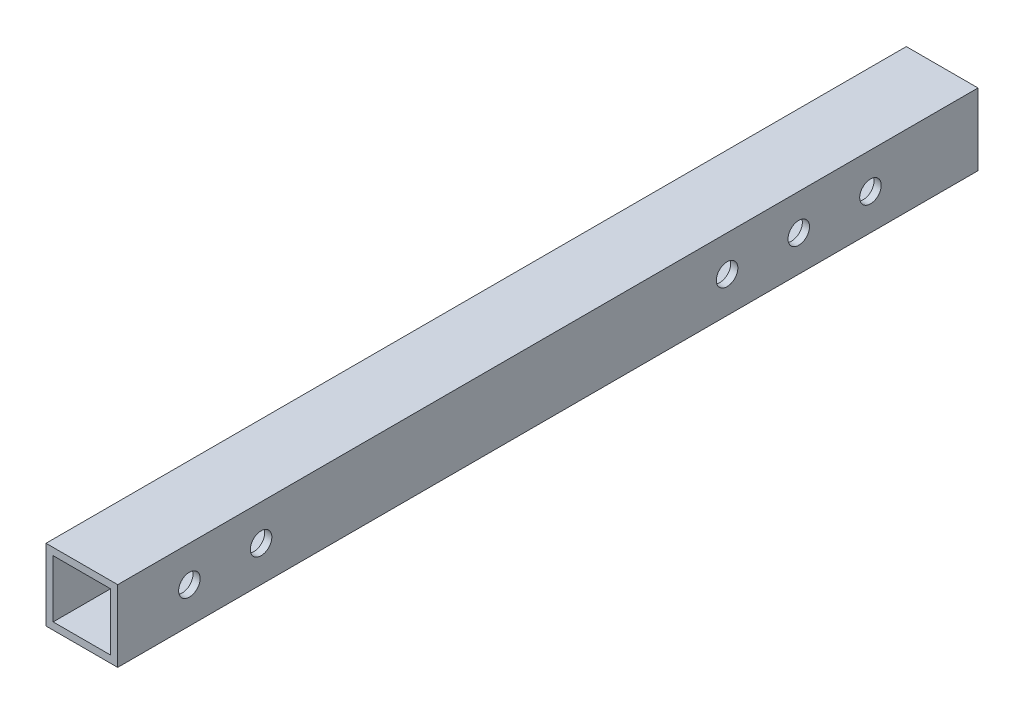
ISO-10303-21;
HEADER;
FILE_DESCRIPTION(('STEP AP214'),'2;1');
FILE_NAME('part.step','',(''),(''),'','','');
FILE_SCHEMA(('AUTOMOTIVE_DESIGN { 1 0 10303 214 1 1 1 1 }'));
ENDSEC;
DATA;
#1=APPLICATION_CONTEXT('core data for automotive mechanical design processes');
#2=APPLICATION_PROTOCOL_DEFINITION('international standard','automotive_design',2000,#1);
#3=PRODUCT_CONTEXT('',#1,'mechanical');
#4=PRODUCT('Part','Part','',(#3));
#5=PRODUCT_RELATED_PRODUCT_CATEGORY('part','',(#4));
#6=PRODUCT_DEFINITION_FORMATION('','',#4);
#7=PRODUCT_DEFINITION_CONTEXT('part definition',#1,'design');
#8=PRODUCT_DEFINITION('design','',#6,#7);
#9=PRODUCT_DEFINITION_SHAPE('','',#8);
#10=(LENGTH_UNIT() NAMED_UNIT(*) SI_UNIT(.MILLI.,.METRE.));
#11=(NAMED_UNIT(*) PLANE_ANGLE_UNIT() SI_UNIT($,.RADIAN.));
#12=(NAMED_UNIT(*) SI_UNIT($,.STERADIAN.) SOLID_ANGLE_UNIT());
#13=UNCERTAINTY_MEASURE_WITH_UNIT(LENGTH_MEASURE(1.E-05),#10,'distance_accuracy_value','');
#14=(GEOMETRIC_REPRESENTATION_CONTEXT(3) GLOBAL_UNCERTAINTY_ASSIGNED_CONTEXT((#13)) GLOBAL_UNIT_ASSIGNED_CONTEXT((#10,
#11,#12)) REPRESENTATION_CONTEXT('',''));
#15=CARTESIAN_POINT('',(0.,0.,0.));
#16=DIRECTION('',(0.,0.,1.));
#17=DIRECTION('',(1.,0.,0.));
#18=AXIS2_PLACEMENT_3D('',#15,#16,#17);
#19=CARTESIAN_POINT('',(10.,5.,36.6455856590386));
#20=DIRECTION('',(-1.,0.,0.));
#21=DIRECTION('',(0.,0.,1.));
#22=AXIS2_PLACEMENT_3D('',#19,#20,#21);
#23=CYLINDRICAL_SURFACE('',#22,1.5);
#24=CARTESIAN_POINT('',(9.,5.,36.6455856590386));
#25=DIRECTION('',(1.,0.,0.));
#26=DIRECTION('',(0.,1.,0.));
#27=AXIS2_PLACEMENT_3D('',#24,#25,#26);
#28=CIRCLE('',#27,1.5);
#29=CARTESIAN_POINT('',(9.,6.5,36.6455856590386));
#30=VERTEX_POINT('',#29);
#31=EDGE_CURVE('E159',#30,#30,#28,.T.);
#32=ORIENTED_EDGE('',*,*,#31,.F.);
#33=EDGE_LOOP('',(#32));
#34=FACE_BOUND('',#33,.T.);
#35=CARTESIAN_POINT('',(10.,5.,36.6455856590386));
#36=DIRECTION('',(1.,0.,0.));
#37=DIRECTION('',(0.,0.,-1.));
#38=AXIS2_PLACEMENT_3D('',#35,#36,#37);
#39=CIRCLE('',#38,1.5);
#40=CARTESIAN_POINT('',(10.,5.,35.1455856590386));
#41=VERTEX_POINT('',#40);
#42=EDGE_CURVE('E187',#41,#41,#39,.T.);
#43=ORIENTED_EDGE('',*,*,#42,.T.);
#44=EDGE_LOOP('',(#43));
#45=FACE_BOUND('',#44,.T.);
#46=ADVANCED_FACE('F35',(#34,#45),#23,.F.);
#47=CARTESIAN_POINT('',(10.,5.,-58.3544143409614));
#48=DIRECTION('',(-1.,0.,0.));
#49=DIRECTION('',(0.,0.,1.));
#50=AXIS2_PLACEMENT_3D('',#47,#48,#49);
#51=CYLINDRICAL_SURFACE('',#50,1.5);
#52=CARTESIAN_POINT('',(9.,5.,-58.3544143409614));
#53=DIRECTION('',(1.,0.,0.));
#54=DIRECTION('',(0.,1.,0.));
#55=AXIS2_PLACEMENT_3D('',#52,#53,#54);
#56=CIRCLE('',#55,1.5);
#57=CARTESIAN_POINT('',(9.,6.5,-58.3544143409614));
#58=VERTEX_POINT('',#57);
#59=EDGE_CURVE('E156',#58,#58,#56,.T.);
#60=ORIENTED_EDGE('',*,*,#59,.F.);
#61=EDGE_LOOP('',(#60));
#62=FACE_BOUND('',#61,.T.);
#63=CARTESIAN_POINT('',(10.,5.,-58.3544143409614));
#64=DIRECTION('',(1.,0.,0.));
#65=DIRECTION('',(0.,0.,-1.));
#66=AXIS2_PLACEMENT_3D('',#63,#64,#65);
#67=CIRCLE('',#66,1.5);
#68=CARTESIAN_POINT('',(10.,5.,-59.8544143409614));
#69=VERTEX_POINT('',#68);
#70=EDGE_CURVE('E181',#69,#69,#67,.T.);
#71=ORIENTED_EDGE('',*,*,#70,.T.);
#72=EDGE_LOOP('',(#71));
#73=FACE_BOUND('',#72,.T.);
#74=ADVANCED_FACE('F246',(#62,#73),#51,.F.);
#75=CARTESIAN_POINT('',(10.,5.,26.6455856590386));
#76=DIRECTION('',(-1.,0.,0.));
#77=DIRECTION('',(0.,0.,1.));
#78=AXIS2_PLACEMENT_3D('',#75,#76,#77);
#79=CYLINDRICAL_SURFACE('',#78,1.5);
#80=CARTESIAN_POINT('',(9.,5.,26.6455856590386));
#81=DIRECTION('',(1.,0.,0.));
#82=DIRECTION('',(0.,1.,0.));
#83=AXIS2_PLACEMENT_3D('',#80,#81,#82);
#84=CIRCLE('',#83,1.5);
#85=CARTESIAN_POINT('',(9.,6.5,26.6455856590386));
#86=VERTEX_POINT('',#85);
#87=EDGE_CURVE('E153',#86,#86,#84,.T.);
#88=ORIENTED_EDGE('',*,*,#87,.F.);
#89=EDGE_LOOP('',(#88));
#90=FACE_BOUND('',#89,.T.);
#91=CARTESIAN_POINT('',(10.,5.,26.6455856590386));
#92=DIRECTION('',(1.,0.,0.));
#93=DIRECTION('',(0.,0.,-1.));
#94=AXIS2_PLACEMENT_3D('',#91,#92,#93);
#95=CIRCLE('',#94,1.5);
#96=CARTESIAN_POINT('',(10.,5.,25.1455856590386));
#97=VERTEX_POINT('',#96);
#98=EDGE_CURVE('E175',#97,#97,#95,.T.);
#99=ORIENTED_EDGE('',*,*,#98,.T.);
#100=EDGE_LOOP('',(#99));
#101=FACE_BOUND('',#100,.T.);
#102=ADVANCED_FACE('F253',(#90,#101),#79,.F.);
#103=CARTESIAN_POINT('',(10.,4.99999999999993,-48.3544143409614));
#104=DIRECTION('',(-1.,0.,0.));
#105=DIRECTION('',(0.,0.,1.));
#106=AXIS2_PLACEMENT_3D('',#103,#104,#105);
#107=CYLINDRICAL_SURFACE('',#106,1.5);
#108=CARTESIAN_POINT('',(9.,4.99999999999993,-48.3544143409614));
#109=DIRECTION('',(1.,0.,0.));
#110=DIRECTION('',(0.,1.,0.));
#111=AXIS2_PLACEMENT_3D('',#108,#109,#110);
#112=CIRCLE('',#111,1.5);
#113=CARTESIAN_POINT('',(9.,6.49999999999993,-48.3544143409614));
#114=VERTEX_POINT('',#113);
#115=EDGE_CURVE('E150',#114,#114,#112,.T.);
#116=ORIENTED_EDGE('',*,*,#115,.F.);
#117=EDGE_LOOP('',(#116));
#118=FACE_BOUND('',#117,.T.);
#119=CARTESIAN_POINT('',(10.,4.99999999999993,-48.3544143409614));
#120=DIRECTION('',(1.,0.,0.));
#121=DIRECTION('',(0.,0.,-1.));
#122=AXIS2_PLACEMENT_3D('',#119,#120,#121);
#123=CIRCLE('',#122,1.5);
#124=CARTESIAN_POINT('',(10.,4.99999999999993,-49.8544143409614));
#125=VERTEX_POINT('',#124);
#126=EDGE_CURVE('E169',#125,#125,#123,.T.);
#127=ORIENTED_EDGE('',*,*,#126,.T.);
#128=EDGE_LOOP('',(#127));
#129=FACE_BOUND('',#128,.T.);
#130=ADVANCED_FACE('F283',(#118,#129),#107,.F.);
#131=CARTESIAN_POINT('',(10.,4.99999999999986,-38.3544143409614));
#132=DIRECTION('',(-1.,0.,0.));
#133=DIRECTION('',(0.,0.,1.));
#134=AXIS2_PLACEMENT_3D('',#131,#132,#133);
#135=CYLINDRICAL_SURFACE('',#134,1.5);
#136=CARTESIAN_POINT('',(9.,4.99999999999986,-38.3544143409614));
#137=DIRECTION('',(1.,0.,0.));
#138=DIRECTION('',(0.,1.,0.));
#139=AXIS2_PLACEMENT_3D('',#136,#137,#138);
#140=CIRCLE('',#139,1.5);
#141=CARTESIAN_POINT('',(9.,6.49999999999986,-38.3544143409614));
#142=VERTEX_POINT('',#141);
#143=EDGE_CURVE('E39',#142,#142,#140,.T.);
#144=ORIENTED_EDGE('',*,*,#143,.F.);
#145=EDGE_LOOP('',(#144));
#146=FACE_BOUND('',#145,.T.);
#147=CARTESIAN_POINT('',(10.,4.99999999999986,-38.3544143409614));
#148=DIRECTION('',(1.,0.,0.));
#149=DIRECTION('',(0.,0.,-1.));
#150=AXIS2_PLACEMENT_3D('',#147,#148,#149);
#151=CIRCLE('',#150,1.5);
#152=CARTESIAN_POINT('',(10.,4.99999999999986,-39.8544143409614));
#153=VERTEX_POINT('',#152);
#154=EDGE_CURVE('E163',#153,#153,#151,.T.);
#155=ORIENTED_EDGE('',*,*,#154,.T.);
#156=EDGE_LOOP('',(#155));
#157=FACE_BOUND('',#156,.T.);
#158=ADVANCED_FACE('F227',(#146,#157),#135,.F.);
#159=CARTESIAN_POINT('',(10.,0.,0.));
#160=DIRECTION('',(1.,0.,0.));
#161=DIRECTION('',(0.,0.,-1.));
#162=AXIS2_PLACEMENT_3D('',#159,#160,#161);
#163=PLANE('',#162);
#164=ORIENTED_EDGE('',*,*,#126,.F.);
#165=EDGE_LOOP('',(#164));
#166=FACE_BOUND('',#165,.T.);
#167=ORIENTED_EDGE('',*,*,#70,.F.);
#168=EDGE_LOOP('',(#167));
#169=FACE_BOUND('',#168,.T.);
#170=DIRECTION('',(0.,-1.,0.));
#171=VECTOR('',#170,1.);
#172=CARTESIAN_POINT('',(10.,10.,46.6455856590386));
#173=LINE('',#172,#171);
#174=CARTESIAN_POINT('',(10.,10.,46.6455856590386));
#175=VERTEX_POINT('',#174);
#176=CARTESIAN_POINT('',(10.,0.,46.6455856590386));
#177=VERTEX_POINT('',#176);
#178=EDGE_CURVE('E193',#175,#177,#173,.T.);
#179=ORIENTED_EDGE('',*,*,#178,.T.);
#180=DIRECTION('',(0.,0.,-1.));
#181=VECTOR('',#180,1.);
#182=CARTESIAN_POINT('',(10.,0.,46.6455856590386));
#183=LINE('',#182,#181);
#184=CARTESIAN_POINT('',(10.,0.,-73.3544143409614));
#185=VERTEX_POINT('',#184);
#186=EDGE_CURVE('E196',#177,#185,#183,.T.);
#187=ORIENTED_EDGE('',*,*,#186,.T.);
#188=DIRECTION('',(0.,1.,0.));
#189=VECTOR('',#188,1.);
#190=CARTESIAN_POINT('',(10.,10.,-73.3544143409614));
#191=LINE('',#190,#189);
#192=CARTESIAN_POINT('',(10.,10.,-73.3544143409614));
#193=VERTEX_POINT('',#192);
#194=EDGE_CURVE('E199',#185,#193,#191,.T.);
#195=ORIENTED_EDGE('',*,*,#194,.T.);
#196=DIRECTION('',(0.,0.,1.));
#197=VECTOR('',#196,1.);
#198=CARTESIAN_POINT('',(10.,10.,46.6455856590386));
#199=LINE('',#198,#197);
#200=EDGE_CURVE('E201',#193,#175,#199,.T.);
#201=ORIENTED_EDGE('',*,*,#200,.T.);
#202=EDGE_LOOP('',(#179,#187,#195,#201));
#203=FACE_BOUND('',#202,.T.);
#204=ORIENTED_EDGE('',*,*,#42,.F.);
#205=EDGE_LOOP('',(#204));
#206=FACE_BOUND('',#205,.T.);
#207=ORIENTED_EDGE('',*,*,#98,.F.);
#208=EDGE_LOOP('',(#207));
#209=FACE_BOUND('',#208,.T.);
#210=ORIENTED_EDGE('',*,*,#154,.F.);
#211=EDGE_LOOP('',(#210));
#212=FACE_BOUND('',#211,.T.);
#213=ADVANCED_FACE('F232',(#166,#169,#203,#206,#209,#212),#163,.T.);
#214=CARTESIAN_POINT('',(0.,0.,0.));
#215=DIRECTION('',(1.,0.,0.));
#216=DIRECTION('',(0.,0.,-1.));
#217=AXIS2_PLACEMENT_3D('',#214,#215,#216);
#218=PLANE('',#217);
#219=DIRECTION('',(0.,-1.,0.));
#220=VECTOR('',#219,1.);
#221=CARTESIAN_POINT('',(0.,10.,46.6455856590386));
#222=LINE('',#221,#220);
#223=CARTESIAN_POINT('',(0.,10.,46.6455856590386));
#224=VERTEX_POINT('',#223);
#225=CARTESIAN_POINT('',(0.,0.,46.6455856590386));
#226=VERTEX_POINT('',#225);
#227=EDGE_CURVE('E190',#224,#226,#222,.T.);
#228=ORIENTED_EDGE('',*,*,#227,.F.);
#229=DIRECTION('',(0.,0.,1.));
#230=VECTOR('',#229,1.);
#231=CARTESIAN_POINT('',(0.,10.,46.6455856590386));
#232=LINE('',#231,#230);
#233=CARTESIAN_POINT('',(0.,10.,-73.3544143409614));
#234=VERTEX_POINT('',#233);
#235=EDGE_CURVE('E197',#234,#224,#232,.T.);
#236=ORIENTED_EDGE('',*,*,#235,.F.);
#237=DIRECTION('',(0.,1.,0.));
#238=VECTOR('',#237,1.);
#239=CARTESIAN_POINT('',(0.,10.,-73.3544143409614));
#240=LINE('',#239,#238);
#241=CARTESIAN_POINT('',(0.,0.,-73.3544143409614));
#242=VERTEX_POINT('',#241);
#243=EDGE_CURVE('E208',#242,#234,#240,.T.);
#244=ORIENTED_EDGE('',*,*,#243,.F.);
#245=DIRECTION('',(0.,0.,-1.));
#246=VECTOR('',#245,1.);
#247=CARTESIAN_POINT('',(0.,0.,46.6455856590386));
#248=LINE('',#247,#246);
#249=EDGE_CURVE('E206',#226,#242,#248,.T.);
#250=ORIENTED_EDGE('',*,*,#249,.F.);
#251=EDGE_LOOP('',(#228,#236,#244,#250));
#252=FACE_BOUND('',#251,.T.);
#253=CARTESIAN_POINT('',(0.,5.,36.6455856590386));
#254=DIRECTION('',(1.,0.,0.));
#255=DIRECTION('',(0.,0.,-1.));
#256=AXIS2_PLACEMENT_3D('',#253,#254,#255);
#257=CIRCLE('',#256,1.5);
#258=CARTESIAN_POINT('',(0.,5.,35.1455856590386));
#259=VERTEX_POINT('',#258);
#260=EDGE_CURVE('E184',#259,#259,#257,.T.);
#261=ORIENTED_EDGE('',*,*,#260,.T.);
#262=EDGE_LOOP('',(#261));
#263=FACE_BOUND('',#262,.T.);
#264=CARTESIAN_POINT('',(0.,5.,-58.3544143409614));
#265=DIRECTION('',(1.,0.,0.));
#266=DIRECTION('',(0.,0.,-1.));
#267=AXIS2_PLACEMENT_3D('',#264,#265,#266);
#268=CIRCLE('',#267,1.5);
#269=CARTESIAN_POINT('',(0.,5.,-59.8544143409614));
#270=VERTEX_POINT('',#269);
#271=EDGE_CURVE('E178',#270,#270,#268,.T.);
#272=ORIENTED_EDGE('',*,*,#271,.T.);
#273=EDGE_LOOP('',(#272));
#274=FACE_BOUND('',#273,.T.);
#275=CARTESIAN_POINT('',(0.,5.,26.6455856590386));
#276=DIRECTION('',(1.,0.,0.));
#277=DIRECTION('',(0.,0.,-1.));
#278=AXIS2_PLACEMENT_3D('',#275,#276,#277);
#279=CIRCLE('',#278,1.5);
#280=CARTESIAN_POINT('',(0.,5.,25.1455856590386));
#281=VERTEX_POINT('',#280);
#282=EDGE_CURVE('E172',#281,#281,#279,.T.);
#283=ORIENTED_EDGE('',*,*,#282,.T.);
#284=EDGE_LOOP('',(#283));
#285=FACE_BOUND('',#284,.T.);
#286=CARTESIAN_POINT('',(0.,4.99999999999993,-48.3544143409614));
#287=DIRECTION('',(1.,0.,0.));
#288=DIRECTION('',(0.,0.,-1.));
#289=AXIS2_PLACEMENT_3D('',#286,#287,#288);
#290=CIRCLE('',#289,1.5);
#291=CARTESIAN_POINT('',(0.,4.99999999999993,-49.8544143409614));
#292=VERTEX_POINT('',#291);
#293=EDGE_CURVE('E166',#292,#292,#290,.T.);
#294=ORIENTED_EDGE('',*,*,#293,.T.);
#295=EDGE_LOOP('',(#294));
#296=FACE_BOUND('',#295,.T.);
#297=CARTESIAN_POINT('',(0.,4.99999999999986,-38.3544143409614));
#298=DIRECTION('',(1.,0.,0.));
#299=DIRECTION('',(0.,0.,-1.));
#300=AXIS2_PLACEMENT_3D('',#297,#298,#299);
#301=CIRCLE('',#300,1.5);
#302=CARTESIAN_POINT('',(0.,4.99999999999986,-39.8544143409614));
#303=VERTEX_POINT('',#302);
#304=EDGE_CURVE('E162',#303,#303,#301,.T.);
#305=ORIENTED_EDGE('',*,*,#304,.T.);
#306=EDGE_LOOP('',(#305));
#307=FACE_BOUND('',#306,.T.);
#308=ADVANCED_FACE('F230',(#252,#263,#274,#285,#296,#307),#218,.F.);
#309=CARTESIAN_POINT('',(10.,10.,46.6455856590386));
#310=DIRECTION('',(0.,0.,-1.));
#311=DIRECTION('',(-1.,0.,0.));
#312=AXIS2_PLACEMENT_3D('',#309,#310,#311);
#313=PLANE('',#312);
#314=DIRECTION('',(1.,0.,0.));
#315=VECTOR('',#314,1.);
#316=CARTESIAN_POINT('',(9.,9.,46.6455856590386));
#317=LINE('',#316,#315);
#318=CARTESIAN_POINT('',(1.,9.,46.6455856590386));
#319=VERTEX_POINT('',#318);
#320=CARTESIAN_POINT('',(9.,9.,46.6455856590386));
#321=VERTEX_POINT('',#320);
#322=EDGE_CURVE('E110',#319,#321,#317,.T.);
#323=ORIENTED_EDGE('',*,*,#322,.T.);
#324=DIRECTION('',(0.,-1.,0.));
#325=VECTOR('',#324,1.);
#326=CARTESIAN_POINT('',(9.,9.,46.6455856590386));
#327=LINE('',#326,#325);
#328=CARTESIAN_POINT('',(9.,1.,46.6455856590386));
#329=VERTEX_POINT('',#328);
#330=EDGE_CURVE('E104',#321,#329,#327,.T.);
#331=ORIENTED_EDGE('',*,*,#330,.T.);
#332=DIRECTION('',(-1.,0.,0.));
#333=VECTOR('',#332,1.);
#334=CARTESIAN_POINT('',(9.,1.,46.6455856590386));
#335=LINE('',#334,#333);
#336=CARTESIAN_POINT('',(0.999999999999999,1.,46.6455856590386));
#337=VERTEX_POINT('',#336);
#338=EDGE_CURVE('E113',#329,#337,#335,.T.);
#339=ORIENTED_EDGE('',*,*,#338,.T.);
#340=DIRECTION('',(0.,1.,0.));
#341=VECTOR('',#340,1.);
#342=CARTESIAN_POINT('',(1.,9.,46.6455856590386));
#343=LINE('',#342,#341);
#344=EDGE_CURVE('E52',#337,#319,#343,.T.);
#345=ORIENTED_EDGE('',*,*,#344,.T.);
#346=EDGE_LOOP('',(#323,#331,#339,#345));
#347=FACE_BOUND('',#346,.T.);
#348=ORIENTED_EDGE('',*,*,#227,.T.);
#349=DIRECTION('',(-1.,0.,0.));
#350=VECTOR('',#349,1.);
#351=CARTESIAN_POINT('',(10.,0.,46.6455856590386));
#352=LINE('',#351,#350);
#353=EDGE_CURVE('E11',#177,#226,#352,.T.);
#354=ORIENTED_EDGE('',*,*,#353,.F.);
#355=ORIENTED_EDGE('',*,*,#178,.F.);
#356=DIRECTION('',(-1.,0.,0.));
#357=VECTOR('',#356,1.);
#358=CARTESIAN_POINT('',(10.,10.,46.6455856590386));
#359=LINE('',#358,#357);
#360=EDGE_CURVE('E203',#175,#224,#359,.T.);
#361=ORIENTED_EDGE('',*,*,#360,.T.);
#362=EDGE_LOOP('',(#348,#354,#355,#361));
#363=FACE_BOUND('',#362,.T.);
#364=ADVANCED_FACE('F37',(#347,#363),#313,.F.);
#365=CARTESIAN_POINT('',(10.,0.,46.6455856590386));
#366=DIRECTION('',(0.,1.,0.));
#367=DIRECTION('',(0.,0.,1.));
#368=AXIS2_PLACEMENT_3D('',#365,#366,#367);
#369=PLANE('',#368);
#370=ORIENTED_EDGE('',*,*,#249,.T.);
#371=DIRECTION('',(-1.,0.,0.));
#372=VECTOR('',#371,1.);
#373=CARTESIAN_POINT('',(10.,0.,-73.3544143409614));
#374=LINE('',#373,#372);
#375=EDGE_CURVE('E44',#185,#242,#374,.T.);
#376=ORIENTED_EDGE('',*,*,#375,.F.);
#377=ORIENTED_EDGE('',*,*,#186,.F.);
#378=ORIENTED_EDGE('',*,*,#353,.T.);
#379=EDGE_LOOP('',(#370,#376,#377,#378));
#380=FACE_BOUND('',#379,.T.);
#381=ADVANCED_FACE('F239',(#380),#369,.F.);
#382=CARTESIAN_POINT('',(10.,10.,-73.3544143409614));
#383=DIRECTION('',(0.,0.,1.));
#384=DIRECTION('',(1.,0.,0.));
#385=AXIS2_PLACEMENT_3D('',#382,#383,#384);
#386=PLANE('',#385);
#387=DIRECTION('',(-1.,0.,0.));
#388=VECTOR('',#387,1.);
#389=CARTESIAN_POINT('',(9.,1.,-73.3544143409614));
#390=LINE('',#389,#388);
#391=CARTESIAN_POINT('',(9.,1.,-73.3544143409614));
#392=VERTEX_POINT('',#391);
#393=CARTESIAN_POINT('',(0.999999999999999,1.,-73.3544143409614));
#394=VERTEX_POINT('',#393);
#395=EDGE_CURVE('E128',#392,#394,#390,.T.);
#396=ORIENTED_EDGE('',*,*,#395,.F.);
#397=DIRECTION('',(0.,-1.,0.));
#398=VECTOR('',#397,1.);
#399=CARTESIAN_POINT('',(9.,9.,-73.3544143409614));
#400=LINE('',#399,#398);
#401=CARTESIAN_POINT('',(9.,9.,-73.3544143409614));
#402=VERTEX_POINT('',#401);
#403=EDGE_CURVE('E60',#402,#392,#400,.T.);
#404=ORIENTED_EDGE('',*,*,#403,.F.);
#405=DIRECTION('',(1.,0.,0.));
#406=VECTOR('',#405,1.);
#407=CARTESIAN_POINT('',(9.,9.,-73.3544143409614));
#408=LINE('',#407,#406);
#409=CARTESIAN_POINT('',(1.,9.,-73.3544143409614));
#410=VERTEX_POINT('',#409);
#411=EDGE_CURVE('E119',#410,#402,#408,.T.);
#412=ORIENTED_EDGE('',*,*,#411,.F.);
#413=DIRECTION('',(0.,1.,0.));
#414=VECTOR('',#413,1.);
#415=CARTESIAN_POINT('',(1.,9.,-73.3544143409614));
#416=LINE('',#415,#414);
#417=EDGE_CURVE('E122',#394,#410,#416,.T.);
#418=ORIENTED_EDGE('',*,*,#417,.F.);
#419=EDGE_LOOP('',(#396,#404,#412,#418));
#420=FACE_BOUND('',#419,.T.);
#421=ORIENTED_EDGE('',*,*,#243,.T.);
#422=DIRECTION('',(-1.,0.,0.));
#423=VECTOR('',#422,1.);
#424=CARTESIAN_POINT('',(10.,10.,-73.3544143409614));
#425=LINE('',#424,#423);
#426=EDGE_CURVE('E213',#193,#234,#425,.T.);
#427=ORIENTED_EDGE('',*,*,#426,.F.);
#428=ORIENTED_EDGE('',*,*,#194,.F.);
#429=ORIENTED_EDGE('',*,*,#375,.T.);
#430=EDGE_LOOP('',(#421,#427,#428,#429));
#431=FACE_BOUND('',#430,.T.);
#432=ADVANCED_FACE('F268',(#420,#431),#386,.F.);
#433=CARTESIAN_POINT('',(10.,10.,46.6455856590386));
#434=DIRECTION('',(0.,-1.,0.));
#435=DIRECTION('',(0.,0.,-1.));
#436=AXIS2_PLACEMENT_3D('',#433,#434,#435);
#437=PLANE('',#436);
#438=ORIENTED_EDGE('',*,*,#235,.T.);
#439=ORIENTED_EDGE('',*,*,#360,.F.);
#440=ORIENTED_EDGE('',*,*,#200,.F.);
#441=ORIENTED_EDGE('',*,*,#426,.T.);
#442=EDGE_LOOP('',(#438,#439,#440,#441));
#443=FACE_BOUND('',#442,.T.);
#444=ADVANCED_FACE('F260',(#443),#437,.F.);
#445=CARTESIAN_POINT('',(0.999999999999999,5.,36.6455856590386));
#446=DIRECTION('',(-1.,0.,0.));
#447=DIRECTION('',(0.,-1.,0.));
#448=AXIS2_PLACEMENT_3D('',#445,#446,#447);
#449=CIRCLE('',#448,1.5);
#450=CARTESIAN_POINT('',(0.999999999999999,3.5,36.6455856590386));
#451=VERTEX_POINT('',#450);
#452=EDGE_CURVE('E147',#451,#451,#449,.T.);
#453=ORIENTED_EDGE('',*,*,#452,.F.);
#454=EDGE_LOOP('',(#453));
#455=FACE_BOUND('',#454,.T.);
#456=ORIENTED_EDGE('',*,*,#260,.F.);
#457=EDGE_LOOP('',(#456));
#458=FACE_BOUND('',#457,.T.);
#459=ADVANCED_FACE('F249',(#455,#458),#23,.F.);
#460=CARTESIAN_POINT('',(0.999999999999999,5.,-58.3544143409614));
#461=DIRECTION('',(-1.,0.,0.));
#462=DIRECTION('',(0.,-1.,0.));
#463=AXIS2_PLACEMENT_3D('',#460,#461,#462);
#464=CIRCLE('',#463,1.5);
#465=CARTESIAN_POINT('',(0.999999999999999,3.5,-58.3544143409614));
#466=VERTEX_POINT('',#465);
#467=EDGE_CURVE('E144',#466,#466,#464,.T.);
#468=ORIENTED_EDGE('',*,*,#467,.F.);
#469=EDGE_LOOP('',(#468));
#470=FACE_BOUND('',#469,.T.);
#471=ORIENTED_EDGE('',*,*,#271,.F.);
#472=EDGE_LOOP('',(#471));
#473=FACE_BOUND('',#472,.T.);
#474=ADVANCED_FACE('F256',(#470,#473),#51,.F.);
#475=CARTESIAN_POINT('',(0.999999999999999,5.,26.6455856590386));
#476=DIRECTION('',(-1.,0.,0.));
#477=DIRECTION('',(0.,-1.,0.));
#478=AXIS2_PLACEMENT_3D('',#475,#476,#477);
#479=CIRCLE('',#478,1.5);
#480=CARTESIAN_POINT('',(0.999999999999999,3.5,26.6455856590386));
#481=VERTEX_POINT('',#480);
#482=EDGE_CURVE('E141',#481,#481,#479,.T.);
#483=ORIENTED_EDGE('',*,*,#482,.F.);
#484=EDGE_LOOP('',(#483));
#485=FACE_BOUND('',#484,.T.);
#486=ORIENTED_EDGE('',*,*,#282,.F.);
#487=EDGE_LOOP('',(#486));
#488=FACE_BOUND('',#487,.T.);
#489=ADVANCED_FACE('F266',(#485,#488),#79,.F.);
#490=CARTESIAN_POINT('',(0.999999999999999,4.99999999999993,-48.3544143409614));
#491=DIRECTION('',(-1.,0.,0.));
#492=DIRECTION('',(0.,-1.,0.));
#493=AXIS2_PLACEMENT_3D('',#490,#491,#492);
#494=CIRCLE('',#493,1.5);
#495=CARTESIAN_POINT('',(0.999999999999999,3.49999999999993,-48.3544143409614));
#496=VERTEX_POINT('',#495);
#497=EDGE_CURVE('E138',#496,#496,#494,.T.);
#498=ORIENTED_EDGE('',*,*,#497,.F.);
#499=EDGE_LOOP('',(#498));
#500=FACE_BOUND('',#499,.T.);
#501=ORIENTED_EDGE('',*,*,#293,.F.);
#502=EDGE_LOOP('',(#501));
#503=FACE_BOUND('',#502,.T.);
#504=ADVANCED_FACE('F225',(#500,#503),#107,.F.);
#505=CARTESIAN_POINT('',(0.999999999999999,4.99999999999986,-38.3544143409614));
#506=DIRECTION('',(-1.,0.,0.));
#507=DIRECTION('',(0.,-1.,0.));
#508=AXIS2_PLACEMENT_3D('',#505,#506,#507);
#509=CIRCLE('',#508,1.5);
#510=CARTESIAN_POINT('',(0.999999999999999,3.49999999999986,-38.3544143409614));
#511=VERTEX_POINT('',#510);
#512=EDGE_CURVE('E134',#511,#511,#509,.T.);
#513=ORIENTED_EDGE('',*,*,#512,.F.);
#514=EDGE_LOOP('',(#513));
#515=FACE_BOUND('',#514,.T.);
#516=ORIENTED_EDGE('',*,*,#304,.F.);
#517=EDGE_LOOP('',(#516));
#518=FACE_BOUND('',#517,.T.);
#519=ADVANCED_FACE('F222',(#515,#518),#135,.F.);
#520=CARTESIAN_POINT('',(9.,9.,46.6455856590386));
#521=DIRECTION('',(1.,0.,0.));
#522=DIRECTION('',(0.,1.,0.));
#523=AXIS2_PLACEMENT_3D('',#520,#521,#522);
#524=PLANE('',#523);
#525=ORIENTED_EDGE('',*,*,#31,.T.);
#526=EDGE_LOOP('',(#525));
#527=FACE_BOUND('',#526,.T.);
#528=ORIENTED_EDGE('',*,*,#59,.T.);
#529=EDGE_LOOP('',(#528));
#530=FACE_BOUND('',#529,.T.);
#531=ORIENTED_EDGE('',*,*,#87,.T.);
#532=EDGE_LOOP('',(#531));
#533=FACE_BOUND('',#532,.T.);
#534=ORIENTED_EDGE('',*,*,#115,.T.);
#535=EDGE_LOOP('',(#534));
#536=FACE_BOUND('',#535,.T.);
#537=ORIENTED_EDGE('',*,*,#143,.T.);
#538=EDGE_LOOP('',(#537));
#539=FACE_BOUND('',#538,.T.);
#540=ORIENTED_EDGE('',*,*,#403,.T.);
#541=DIRECTION('',(0.,0.,-1.));
#542=VECTOR('',#541,1.);
#543=CARTESIAN_POINT('',(9.,1.,46.6455856590386));
#544=LINE('',#543,#542);
#545=EDGE_CURVE('E100',#329,#392,#544,.T.);
#546=ORIENTED_EDGE('',*,*,#545,.F.);
#547=ORIENTED_EDGE('',*,*,#330,.F.);
#548=DIRECTION('',(0.,0.,-1.));
#549=VECTOR('',#548,1.);
#550=CARTESIAN_POINT('',(9.,9.,46.6455856590386));
#551=LINE('',#550,#549);
#552=EDGE_CURVE('E132',#321,#402,#551,.T.);
#553=ORIENTED_EDGE('',*,*,#552,.T.);
#554=EDGE_LOOP('',(#540,#546,#547,#553));
#555=FACE_BOUND('',#554,.T.);
#556=ADVANCED_FACE('F102',(#527,#530,#533,#536,#539,#555),#524,.F.);
#557=CARTESIAN_POINT('',(9.,9.,46.6455856590386));
#558=DIRECTION('',(0.,1.,0.));
#559=DIRECTION('',(0.,0.,1.));
#560=AXIS2_PLACEMENT_3D('',#557,#558,#559);
#561=PLANE('',#560);
#562=ORIENTED_EDGE('',*,*,#411,.T.);
#563=ORIENTED_EDGE('',*,*,#552,.F.);
#564=ORIENTED_EDGE('',*,*,#322,.F.);
#565=DIRECTION('',(0.,0.,-1.));
#566=VECTOR('',#565,1.);
#567=CARTESIAN_POINT('',(1.,9.,46.6455856590386));
#568=LINE('',#567,#566);
#569=EDGE_CURVE('E135',#319,#410,#568,.T.);
#570=ORIENTED_EDGE('',*,*,#569,.T.);
#571=EDGE_LOOP('',(#562,#563,#564,#570));
#572=FACE_BOUND('',#571,.T.);
#573=ADVANCED_FACE('F332',(#572),#561,.F.);
#574=CARTESIAN_POINT('',(1.,9.,46.6455856590386));
#575=DIRECTION('',(-1.,0.,0.));
#576=DIRECTION('',(0.,-1.,0.));
#577=AXIS2_PLACEMENT_3D('',#574,#575,#576);
#578=PLANE('',#577);
#579=ORIENTED_EDGE('',*,*,#452,.T.);
#580=EDGE_LOOP('',(#579));
#581=FACE_BOUND('',#580,.T.);
#582=ORIENTED_EDGE('',*,*,#467,.T.);
#583=EDGE_LOOP('',(#582));
#584=FACE_BOUND('',#583,.T.);
#585=ORIENTED_EDGE('',*,*,#482,.T.);
#586=EDGE_LOOP('',(#585));
#587=FACE_BOUND('',#586,.T.);
#588=ORIENTED_EDGE('',*,*,#497,.T.);
#589=EDGE_LOOP('',(#588));
#590=FACE_BOUND('',#589,.T.);
#591=ORIENTED_EDGE('',*,*,#512,.T.);
#592=EDGE_LOOP('',(#591));
#593=FACE_BOUND('',#592,.T.);
#594=ORIENTED_EDGE('',*,*,#417,.T.);
#595=ORIENTED_EDGE('',*,*,#569,.F.);
#596=ORIENTED_EDGE('',*,*,#344,.F.);
#597=DIRECTION('',(0.,0.,-1.));
#598=VECTOR('',#597,1.);
#599=CARTESIAN_POINT('',(0.999999999999999,1.,46.6455856590386));
#600=LINE('',#599,#598);
#601=EDGE_CURVE('E109',#337,#394,#600,.T.);
#602=ORIENTED_EDGE('',*,*,#601,.T.);
#603=EDGE_LOOP('',(#594,#595,#596,#602));
#604=FACE_BOUND('',#603,.T.);
#605=ADVANCED_FACE('F220',(#581,#584,#587,#590,#593,#604),#578,.F.);
#606=CARTESIAN_POINT('',(9.,1.,46.6455856590386));
#607=DIRECTION('',(0.,-1.,0.));
#608=DIRECTION('',(0.,0.,-1.));
#609=AXIS2_PLACEMENT_3D('',#606,#607,#608);
#610=PLANE('',#609);
#611=ORIENTED_EDGE('',*,*,#395,.T.);
#612=ORIENTED_EDGE('',*,*,#601,.F.);
#613=ORIENTED_EDGE('',*,*,#338,.F.);
#614=ORIENTED_EDGE('',*,*,#545,.T.);
#615=EDGE_LOOP('',(#611,#612,#613,#614));
#616=FACE_BOUND('',#615,.T.);
#617=ADVANCED_FACE('F114',(#616),#610,.F.);
#618=CLOSED_SHELL('',(#46,#74,#102,#130,#158,#213,#308,#364,#381,#432,#444,#459,#474,#489,#504,
#519,#556,#573,#605,#617));
#619=MANIFOLD_SOLID_BREP('B2',#618);
#620=ADVANCED_BREP_SHAPE_REPRESENTATION('',(#18,#619),#14);
#621=SHAPE_DEFINITION_REPRESENTATION(#9,#620);
ENDSEC;
END-ISO-10303-21;
